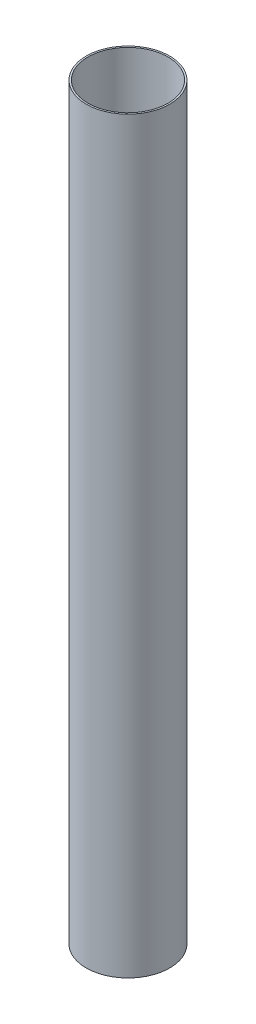
ISO-10303-21;
HEADER;
FILE_DESCRIPTION(('STEP AP214'),'2;1');
FILE_NAME('part.step','',(''),(''),'','','');
FILE_SCHEMA(('AUTOMOTIVE_DESIGN { 1 0 10303 214 1 1 1 1 }'));
ENDSEC;
DATA;
#1=APPLICATION_CONTEXT('core data for automotive mechanical design processes');
#2=APPLICATION_PROTOCOL_DEFINITION('international standard','automotive_design',2000,#1);
#3=PRODUCT_CONTEXT('',#1,'mechanical');
#4=PRODUCT('Part','Part','',(#3));
#5=PRODUCT_RELATED_PRODUCT_CATEGORY('part','',(#4));
#6=PRODUCT_DEFINITION_FORMATION('','',#4);
#7=PRODUCT_DEFINITION_CONTEXT('part definition',#1,'design');
#8=PRODUCT_DEFINITION('design','',#6,#7);
#9=PRODUCT_DEFINITION_SHAPE('','',#8);
#10=(LENGTH_UNIT() NAMED_UNIT(*) SI_UNIT(.MILLI.,.METRE.));
#11=(NAMED_UNIT(*) PLANE_ANGLE_UNIT() SI_UNIT($,.RADIAN.));
#12=(NAMED_UNIT(*) SI_UNIT($,.STERADIAN.) SOLID_ANGLE_UNIT());
#13=UNCERTAINTY_MEASURE_WITH_UNIT(LENGTH_MEASURE(1.E-05),#10,'distance_accuracy_value','');
#14=(GEOMETRIC_REPRESENTATION_CONTEXT(3) GLOBAL_UNCERTAINTY_ASSIGNED_CONTEXT((#13)) GLOBAL_UNIT_ASSIGNED_CONTEXT((#10,
#11,#12)) REPRESENTATION_CONTEXT('',''));
#15=CARTESIAN_POINT('',(0.,0.,0.));
#16=DIRECTION('',(0.,0.,1.));
#17=DIRECTION('',(1.,0.,0.));
#18=AXIS2_PLACEMENT_3D('',#15,#16,#17);
#19=CARTESIAN_POINT('',(0.,1422.4,0.));
#20=DIRECTION('',(0.,1.,0.));
#21=DIRECTION('',(0.,0.,1.));
#22=AXIS2_PLACEMENT_3D('',#19,#20,#21);
#23=PLANE('',#22);
#24=CARTESIAN_POINT('',(0.,1422.4,0.));
#25=DIRECTION('',(0.,1.,0.));
#26=DIRECTION('',(0.,0.,1.));
#27=AXIS2_PLACEMENT_3D('',#24,#25,#26);
#28=CIRCLE('',#27,79.375);
#29=CARTESIAN_POINT('',(0.,1422.4,79.375));
#30=VERTEX_POINT('',#29);
#31=EDGE_CURVE('E10',#30,#30,#28,.T.);
#32=ORIENTED_EDGE('',*,*,#31,.T.);
#33=EDGE_LOOP('',(#32));
#34=FACE_BOUND('',#33,.T.);
#35=CARTESIAN_POINT('',(0.,1422.4,0.));
#36=DIRECTION('',(0.,1.,0.));
#37=DIRECTION('',(0.,0.,1.));
#38=AXIS2_PLACEMENT_3D('',#35,#36,#37);
#39=CIRCLE('',#38,76.2);
#40=CARTESIAN_POINT('',(0.,1422.4,76.2));
#41=VERTEX_POINT('',#40);
#42=EDGE_CURVE('E46',#41,#41,#39,.T.);
#43=ORIENTED_EDGE('',*,*,#42,.F.);
#44=EDGE_LOOP('',(#43));
#45=FACE_BOUND('',#44,.T.);
#46=ADVANCED_FACE('F35',(#34,#45),#23,.T.);
#47=CARTESIAN_POINT('',(0.,0.,0.));
#48=DIRECTION('',(0.,1.,0.));
#49=DIRECTION('',(0.,0.,1.));
#50=AXIS2_PLACEMENT_3D('',#47,#48,#49);
#51=PLANE('',#50);
#52=CARTESIAN_POINT('',(0.,0.,0.));
#53=DIRECTION('',(0.,1.,0.));
#54=DIRECTION('',(0.,0.,1.));
#55=AXIS2_PLACEMENT_3D('',#52,#53,#54);
#56=CIRCLE('',#55,79.375);
#57=CARTESIAN_POINT('',(0.,0.,79.375));
#58=VERTEX_POINT('',#57);
#59=EDGE_CURVE('E39',#58,#58,#56,.T.);
#60=ORIENTED_EDGE('',*,*,#59,.F.);
#61=EDGE_LOOP('',(#60));
#62=FACE_BOUND('',#61,.T.);
#63=CARTESIAN_POINT('',(0.,0.,0.));
#64=DIRECTION('',(0.,1.,0.));
#65=DIRECTION('',(0.,0.,1.));
#66=AXIS2_PLACEMENT_3D('',#63,#64,#65);
#67=CIRCLE('',#66,76.2);
#68=CARTESIAN_POINT('',(0.,0.,76.2));
#69=VERTEX_POINT('',#68);
#70=EDGE_CURVE('E48',#69,#69,#67,.T.);
#71=ORIENTED_EDGE('',*,*,#70,.T.);
#72=EDGE_LOOP('',(#71));
#73=FACE_BOUND('',#72,.T.);
#74=ADVANCED_FACE('F58',(#62,#73),#51,.F.);
#75=CARTESIAN_POINT('',(0.,1422.4,0.));
#76=DIRECTION('',(0.,-1.,0.));
#77=DIRECTION('',(0.,0.,-1.));
#78=AXIS2_PLACEMENT_3D('',#75,#76,#77);
#79=CYLINDRICAL_SURFACE('',#78,79.375);
#80=ORIENTED_EDGE('',*,*,#31,.F.);
#81=EDGE_LOOP('',(#80));
#82=FACE_BOUND('',#81,.T.);
#83=ORIENTED_EDGE('',*,*,#59,.T.);
#84=EDGE_LOOP('',(#83));
#85=FACE_BOUND('',#84,.T.);
#86=ADVANCED_FACE('F37',(#82,#85),#79,.T.);
#87=CARTESIAN_POINT('',(0.,1422.4,0.));
#88=DIRECTION('',(0.,-1.,0.));
#89=DIRECTION('',(0.,0.,-1.));
#90=AXIS2_PLACEMENT_3D('',#87,#88,#89);
#91=CYLINDRICAL_SURFACE('',#90,76.2);
#92=ORIENTED_EDGE('',*,*,#42,.T.);
#93=EDGE_LOOP('',(#92));
#94=FACE_BOUND('',#93,.T.);
#95=ORIENTED_EDGE('',*,*,#70,.F.);
#96=EDGE_LOOP('',(#95));
#97=FACE_BOUND('',#96,.T.);
#98=ADVANCED_FACE('F54',(#94,#97),#91,.F.);
#99=CLOSED_SHELL('',(#46,#74,#86,#98));
#100=MANIFOLD_SOLID_BREP('B2',#99);
#101=ADVANCED_BREP_SHAPE_REPRESENTATION('',(#18,#100),#14);
#102=SHAPE_DEFINITION_REPRESENTATION(#9,#101);
ENDSEC;
END-ISO-10303-21;
